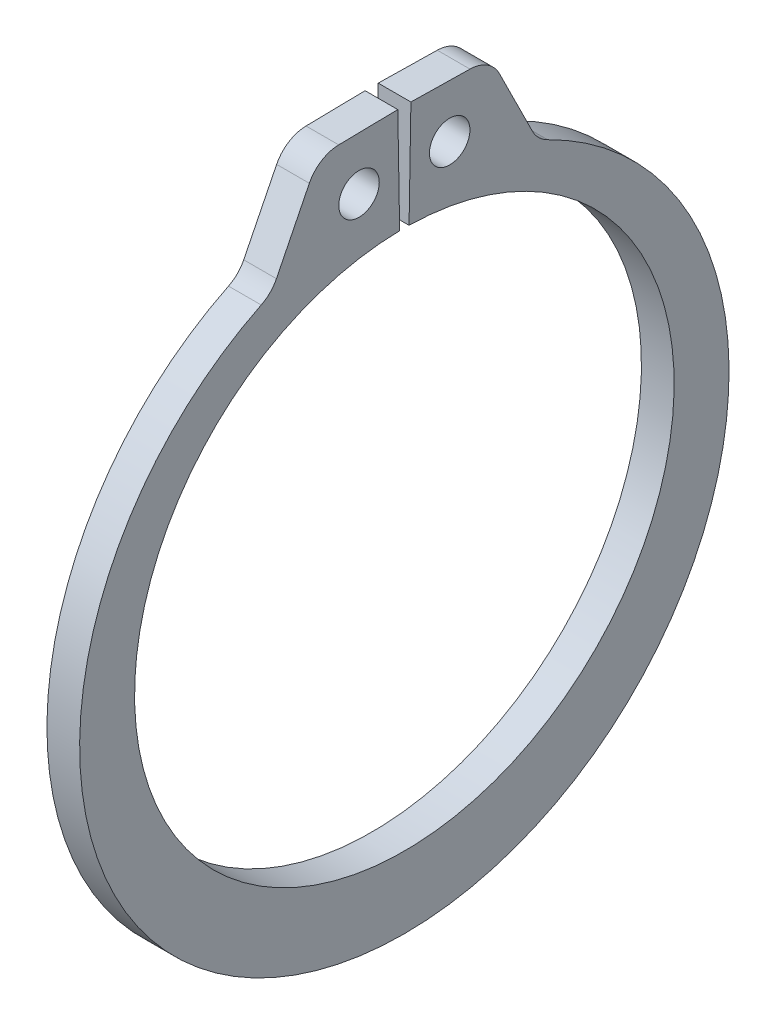
ISO-10303-21;
HEADER;
FILE_DESCRIPTION(('STEP AP214'),'2;1');
FILE_NAME('part.step','',(''),(''),'','','');
FILE_SCHEMA(('AUTOMOTIVE_DESIGN { 1 0 10303 214 1 1 1 1 }'));
ENDSEC;
DATA;
#1=APPLICATION_CONTEXT('core data for automotive mechanical design processes');
#2=APPLICATION_PROTOCOL_DEFINITION('international standard','automotive_design',2000,#1);
#3=PRODUCT_CONTEXT('',#1,'mechanical');
#4=PRODUCT('Part','Part','',(#3));
#5=PRODUCT_RELATED_PRODUCT_CATEGORY('part','',(#4));
#6=PRODUCT_DEFINITION_FORMATION('','',#4);
#7=PRODUCT_DEFINITION_CONTEXT('part definition',#1,'design');
#8=PRODUCT_DEFINITION('design','',#6,#7);
#9=PRODUCT_DEFINITION_SHAPE('','',#8);
#10=(LENGTH_UNIT() NAMED_UNIT(*) SI_UNIT(.MILLI.,.METRE.));
#11=(NAMED_UNIT(*) PLANE_ANGLE_UNIT() SI_UNIT($,.RADIAN.));
#12=(NAMED_UNIT(*) SI_UNIT($,.STERADIAN.) SOLID_ANGLE_UNIT());
#13=UNCERTAINTY_MEASURE_WITH_UNIT(LENGTH_MEASURE(1.E-05),#10,'distance_accuracy_value','');
#14=(GEOMETRIC_REPRESENTATION_CONTEXT(3) GLOBAL_UNCERTAINTY_ASSIGNED_CONTEXT((#13)) GLOBAL_UNIT_ASSIGNED_CONTEXT((#10,
#11,#12)) REPRESENTATION_CONTEXT('',''));
#15=CARTESIAN_POINT('',(0.,0.,0.));
#16=DIRECTION('',(0.,0.,1.));
#17=DIRECTION('',(1.,0.,0.));
#18=AXIS2_PLACEMENT_3D('',#15,#16,#17);
#19=CARTESIAN_POINT('',(0.5334,0.,0.));
#20=DIRECTION('',(1.,0.,0.));
#21=DIRECTION('',(0.,0.,-1.));
#22=AXIS2_PLACEMENT_3D('',#19,#20,#21);
#23=PLANE('',#22);
#24=CARTESIAN_POINT('',(0.5334,10.5040886416162,1.47894687499925));
#25=DIRECTION('',(1.,0.,0.));
#26=DIRECTION('',(0.,0.,-1.));
#27=AXIS2_PLACEMENT_3D('',#24,#25,#26);
#28=CIRCLE('',#27,0.6604);
#29=CARTESIAN_POINT('',(0.5334,10.5040886416162,0.818546874999249));
#30=VERTEX_POINT('',#29);
#31=EDGE_CURVE('E221',#30,#30,#28,.T.);
#32=ORIENTED_EDGE('',*,*,#31,.F.);
#33=EDGE_LOOP('',(#32));
#34=FACE_BOUND('',#33,.T.);
#35=DIRECTION('',(0.,-0.0174524064372888,0.999847695156391));
#36=VECTOR('',#35,1.);
#37=CARTESIAN_POINT('',(0.5334,12.2536334279892,0.213887967092128));
#38=LINE('',#37,#36);
#39=CARTESIAN_POINT('',(0.5334,12.2536334279892,0.213887967092128));
#40=VERTEX_POINT('',#39);
#41=CARTESIAN_POINT('',(0.5334,12.21999978275,2.14075821234739));
#42=VERTEX_POINT('',#41);
#43=EDGE_CURVE('E133',#40,#42,#38,.T.);
#44=ORIENTED_EDGE('',*,*,#43,.T.);
#45=CARTESIAN_POINT('',(0.5334,11.1279661301002,2.12169669403658));
#46=DIRECTION('',(1.,0.,0.));
#47=DIRECTION('',(0.,0.,-1.));
#48=AXIS2_PLACEMENT_3D('',#45,#46,#47);
#49=CIRCLE('',#48,1.0922);
#50=CARTESIAN_POINT('',(0.5334,11.6141614114107,3.09971253666458));
#51=VERTEX_POINT('',#50);
#52=EDGE_CURVE('E174',#42,#51,#49,.T.);
#53=ORIENTED_EDGE('',*,*,#52,.T.);
#54=DIRECTION('',(0.,-0.895454900776411,0.445152244378829));
#55=VECTOR('',#54,1.);
#56=CARTESIAN_POINT('',(0.5334,12.2084177333914,2.80429337570331));
#57=LINE('',#56,#55);
#58=CARTESIAN_POINT('',(0.5334,9.45539137797144,4.17288922557434));
#59=VERTEX_POINT('',#58);
#60=EDGE_CURVE('E213',#51,#59,#57,.T.);
#61=ORIENTED_EDGE('',*,*,#60,.T.);
#62=CARTESIAN_POINT('',(0.5334,9.941586659282,5.15090506820234));
#63=DIRECTION('',(1.,0.,0.));
#64=DIRECTION('',(0.,0.,-1.));
#65=AXIS2_PLACEMENT_3D('',#62,#63,#64);
#66=CIRCLE('',#65,1.0922);
#67=CARTESIAN_POINT('',(0.5334,8.96124610534802,4.66941442622431));
#68=VERTEX_POINT('',#67);
#69=EDGE_CURVE('E181',#59,#68,#66,.F.);
#70=ORIENTED_EDGE('',*,*,#69,.T.);
#71=CARTESIAN_POINT('',(0.5334,-0.545929997486655,0.));
#72=DIRECTION('',(1.,0.,0.));
#73=DIRECTION('',(0.,0.,-1.));
#74=AXIS2_PLACEMENT_3D('',#71,#72,#73);
#75=CIRCLE('',#74,10.5919700025133);
#76=CARTESIAN_POINT('',(0.5334,8.96124610534802,-4.66941442622431));
#77=VERTEX_POINT('',#76);
#78=EDGE_CURVE('E206',#68,#77,#75,.T.);
#79=ORIENTED_EDGE('',*,*,#78,.T.);
#80=CARTESIAN_POINT('',(0.5334,9.941586659282,-5.15090506820234));
#81=DIRECTION('',(1.,0.,0.));
#82=DIRECTION('',(0.,0.,-1.));
#83=AXIS2_PLACEMENT_3D('',#80,#81,#82);
#84=CIRCLE('',#83,1.0922);
#85=CARTESIAN_POINT('',(0.5334,9.45539137797144,-4.17288922557434));
#86=VERTEX_POINT('',#85);
#87=EDGE_CURVE('E11',#77,#86,#84,.F.);
#88=ORIENTED_EDGE('',*,*,#87,.T.);
#89=DIRECTION('',(0.,0.895454900776411,0.445152244378829));
#90=VECTOR('',#89,1.);
#91=CARTESIAN_POINT('',(0.5334,12.2084177333914,-2.80429337570331));
#92=LINE('',#91,#90);
#93=CARTESIAN_POINT('',(0.5334,11.6141614114107,-3.09971253666458));
#94=VERTEX_POINT('',#93);
#95=EDGE_CURVE('E205',#86,#94,#92,.T.);
#96=ORIENTED_EDGE('',*,*,#95,.T.);
#97=CARTESIAN_POINT('',(0.5334,11.1279661301002,-2.12169669403658));
#98=DIRECTION('',(1.,0.,0.));
#99=DIRECTION('',(0.,0.,-1.));
#100=AXIS2_PLACEMENT_3D('',#97,#98,#99);
#101=CIRCLE('',#100,1.0922);
#102=CARTESIAN_POINT('',(0.5334,12.21999978275,-2.14075821234739));
#103=VERTEX_POINT('',#102);
#104=EDGE_CURVE('E49',#94,#103,#101,.T.);
#105=ORIENTED_EDGE('',*,*,#104,.T.);
#106=DIRECTION('',(0.,0.0174524064372888,0.999847695156391));
#107=VECTOR('',#106,1.);
#108=CARTESIAN_POINT('',(0.5334,12.2536334279892,-0.213887967092128));
#109=LINE('',#108,#107);
#110=CARTESIAN_POINT('',(0.5334,12.2536334279892,-0.213887967092128));
#111=VERTEX_POINT('',#110);
#112=EDGE_CURVE('E210',#103,#111,#109,.T.);
#113=ORIENTED_EDGE('',*,*,#112,.T.);
#114=DIRECTION('',(0.,-0.999847695156391,0.0174524064372835));
#115=VECTOR('',#114,1.);
#116=CARTESIAN_POINT('',(0.5334,8.79975954984091,-0.153600374295176));
#117=LINE('',#116,#115);
#118=CARTESIAN_POINT('',(0.5334,8.79975954984091,-0.153600374295176));
#119=VERTEX_POINT('',#118);
#120=EDGE_CURVE('E139',#111,#119,#117,.T.);
#121=ORIENTED_EDGE('',*,*,#120,.T.);
#122=CARTESIAN_POINT('',(0.5334,0.,0.));
#123=DIRECTION('',(-1.,0.,0.));
#124=DIRECTION('',(0.,0.,-1.));
#125=AXIS2_PLACEMENT_3D('',#122,#123,#124);
#126=CIRCLE('',#125,8.8011);
#127=CARTESIAN_POINT('',(0.5334,8.79975954984091,0.153600374295176));
#128=VERTEX_POINT('',#127);
#129=EDGE_CURVE('E134',#119,#128,#126,.T.);
#130=ORIENTED_EDGE('',*,*,#129,.T.);
#131=DIRECTION('',(0.,0.999847695156391,0.0174524064372835));
#132=VECTOR('',#131,1.);
#133=CARTESIAN_POINT('',(0.5334,8.79975954984091,0.153600374295176));
#134=LINE('',#133,#132);
#135=EDGE_CURVE('E125',#128,#40,#134,.T.);
#136=ORIENTED_EDGE('',*,*,#135,.T.);
#137=EDGE_LOOP('',(#44,#53,#61,#70,#79,#88,#96,#105,#113,#121,#130,#136));
#138=FACE_BOUND('',#137,.T.);
#139=CARTESIAN_POINT('',(0.5334,10.5040886416162,-1.47894687499925));
#140=DIRECTION('',(1.,0.,0.));
#141=DIRECTION('',(0.,0.,-1.));
#142=AXIS2_PLACEMENT_3D('',#139,#140,#141);
#143=CIRCLE('',#142,0.6604);
#144=CARTESIAN_POINT('',(0.5334,10.5040886416162,-2.13934687499925));
#145=VERTEX_POINT('',#144);
#146=EDGE_CURVE('E247',#145,#145,#143,.T.);
#147=ORIENTED_EDGE('',*,*,#146,.F.);
#148=EDGE_LOOP('',(#147));
#149=FACE_BOUND('',#148,.T.);
#150=ADVANCED_FACE('F34',(#34,#138,#149),#23,.T.);
#151=CARTESIAN_POINT('',(-0.5334,0.,0.));
#152=DIRECTION('',(1.,0.,0.));
#153=DIRECTION('',(0.,0.,-1.));
#154=AXIS2_PLACEMENT_3D('',#151,#152,#153);
#155=PLANE('',#154);
#156=CARTESIAN_POINT('',(-0.5334,10.5040886416162,1.47894687499925));
#157=DIRECTION('',(1.,0.,0.));
#158=DIRECTION('',(0.,0.,-1.));
#159=AXIS2_PLACEMENT_3D('',#156,#157,#158);
#160=CIRCLE('',#159,0.6604);
#161=CARTESIAN_POINT('',(-0.5334,10.5040886416162,0.818546874999249));
#162=VERTEX_POINT('',#161);
#163=EDGE_CURVE('E244',#162,#162,#160,.T.);
#164=ORIENTED_EDGE('',*,*,#163,.T.);
#165=EDGE_LOOP('',(#164));
#166=FACE_BOUND('',#165,.T.);
#167=DIRECTION('',(0.,-0.895454900776411,0.445152244378829));
#168=VECTOR('',#167,1.);
#169=CARTESIAN_POINT('',(-0.5334,12.2084177333914,2.80429337570331));
#170=LINE('',#169,#168);
#171=CARTESIAN_POINT('',(-0.5334,11.6141614114107,3.09971253666458));
#172=VERTEX_POINT('',#171);
#173=CARTESIAN_POINT('',(-0.5334,9.45539137797144,4.17288922557434));
#174=VERTEX_POINT('',#173);
#175=EDGE_CURVE('E200',#172,#174,#170,.T.);
#176=ORIENTED_EDGE('',*,*,#175,.F.);
#177=CARTESIAN_POINT('',(-0.5334,11.1279661301002,2.12169669403658));
#178=DIRECTION('',(1.,0.,0.));
#179=DIRECTION('',(0.,0.,-1.));
#180=AXIS2_PLACEMENT_3D('',#177,#178,#179);
#181=CIRCLE('',#180,1.0922);
#182=CARTESIAN_POINT('',(-0.5334,12.21999978275,2.14075821234739));
#183=VERTEX_POINT('',#182);
#184=EDGE_CURVE('E170',#172,#183,#181,.F.);
#185=ORIENTED_EDGE('',*,*,#184,.T.);
#186=DIRECTION('',(0.,-0.0174524064372888,0.999847695156391));
#187=VECTOR('',#186,1.);
#188=CARTESIAN_POINT('',(-0.5334,12.2536334279892,0.213887967092128));
#189=LINE('',#188,#187);
#190=CARTESIAN_POINT('',(-0.5334,12.2536334279892,0.213887967092128));
#191=VERTEX_POINT('',#190);
#192=EDGE_CURVE('E223',#191,#183,#189,.T.);
#193=ORIENTED_EDGE('',*,*,#192,.F.);
#194=DIRECTION('',(0.,0.999847695156391,0.0174524064372835));
#195=VECTOR('',#194,1.);
#196=CARTESIAN_POINT('',(-0.5334,8.79975954984091,0.153600374295176));
#197=LINE('',#196,#195);
#198=CARTESIAN_POINT('',(-0.5334,8.79975954984091,0.153600374295176));
#199=VERTEX_POINT('',#198);
#200=EDGE_CURVE('E220',#199,#191,#197,.T.);
#201=ORIENTED_EDGE('',*,*,#200,.F.);
#202=CARTESIAN_POINT('',(-0.5334,0.,0.));
#203=DIRECTION('',(-1.,0.,0.));
#204=DIRECTION('',(0.,0.,-1.));
#205=AXIS2_PLACEMENT_3D('',#202,#203,#204);
#206=CIRCLE('',#205,8.8011);
#207=CARTESIAN_POINT('',(-0.5334,8.79975954984091,-0.153600374295176));
#208=VERTEX_POINT('',#207);
#209=EDGE_CURVE('E147',#208,#199,#206,.T.);
#210=ORIENTED_EDGE('',*,*,#209,.F.);
#211=DIRECTION('',(0.,-0.999847695156391,0.0174524064372835));
#212=VECTOR('',#211,1.);
#213=CARTESIAN_POINT('',(-0.5334,8.79975954984091,-0.153600374295176));
#214=LINE('',#213,#212);
#215=CARTESIAN_POINT('',(-0.5334,12.2536334279892,-0.213887967092128));
#216=VERTEX_POINT('',#215);
#217=EDGE_CURVE('E143',#216,#208,#214,.T.);
#218=ORIENTED_EDGE('',*,*,#217,.F.);
#219=DIRECTION('',(0.,0.0174524064372888,0.999847695156391));
#220=VECTOR('',#219,1.);
#221=CARTESIAN_POINT('',(-0.5334,12.2536334279892,-0.213887967092128));
#222=LINE('',#221,#220);
#223=CARTESIAN_POINT('',(-0.5334,12.21999978275,-2.14075821234739));
#224=VERTEX_POINT('',#223);
#225=EDGE_CURVE('E228',#224,#216,#222,.T.);
#226=ORIENTED_EDGE('',*,*,#225,.F.);
#227=CARTESIAN_POINT('',(-0.5334,11.1279661301002,-2.12169669403658));
#228=DIRECTION('',(1.,0.,0.));
#229=DIRECTION('',(0.,0.,-1.));
#230=AXIS2_PLACEMENT_3D('',#227,#228,#229);
#231=CIRCLE('',#230,1.0922);
#232=CARTESIAN_POINT('',(-0.5334,11.6141614114107,-3.09971253666458));
#233=VERTEX_POINT('',#232);
#234=EDGE_CURVE('E168',#224,#233,#231,.F.);
#235=ORIENTED_EDGE('',*,*,#234,.T.);
#236=DIRECTION('',(0.,0.895454900776411,0.445152244378829));
#237=VECTOR('',#236,1.);
#238=CARTESIAN_POINT('',(-0.5334,12.2084177333914,-2.80429337570331));
#239=LINE('',#238,#237);
#240=CARTESIAN_POINT('',(-0.5334,9.45539137797144,-4.17288922557434));
#241=VERTEX_POINT('',#240);
#242=EDGE_CURVE('E191',#241,#233,#239,.T.);
#243=ORIENTED_EDGE('',*,*,#242,.F.);
#244=CARTESIAN_POINT('',(-0.5334,9.941586659282,-5.15090506820234));
#245=DIRECTION('',(1.,0.,0.));
#246=DIRECTION('',(0.,0.,-1.));
#247=AXIS2_PLACEMENT_3D('',#244,#245,#246);
#248=CIRCLE('',#247,1.0922);
#249=CARTESIAN_POINT('',(-0.5334,8.96124610534802,-4.66941442622431));
#250=VERTEX_POINT('',#249);
#251=EDGE_CURVE('E42',#241,#250,#248,.T.);
#252=ORIENTED_EDGE('',*,*,#251,.T.);
#253=CARTESIAN_POINT('',(-0.5334,-0.545929997486655,0.));
#254=DIRECTION('',(1.,0.,0.));
#255=DIRECTION('',(0.,0.,-1.));
#256=AXIS2_PLACEMENT_3D('',#253,#254,#255);
#257=CIRCLE('',#256,10.5919700025133);
#258=CARTESIAN_POINT('',(-0.5334,8.96124610534802,4.66941442622431));
#259=VERTEX_POINT('',#258);
#260=EDGE_CURVE('E189',#259,#250,#257,.T.);
#261=ORIENTED_EDGE('',*,*,#260,.F.);
#262=CARTESIAN_POINT('',(-0.5334,9.941586659282,5.15090506820234));
#263=DIRECTION('',(1.,0.,0.));
#264=DIRECTION('',(0.,0.,-1.));
#265=AXIS2_PLACEMENT_3D('',#262,#263,#264);
#266=CIRCLE('',#265,1.0922);
#267=EDGE_CURVE('E179',#259,#174,#266,.T.);
#268=ORIENTED_EDGE('',*,*,#267,.T.);
#269=EDGE_LOOP('',(#176,#185,#193,#201,#210,#218,#226,#235,#243,#252,#261,#268));
#270=FACE_BOUND('',#269,.T.);
#271=CARTESIAN_POINT('',(-0.5334,10.5040886416162,-1.47894687499925));
#272=DIRECTION('',(1.,0.,0.));
#273=DIRECTION('',(0.,0.,-1.));
#274=AXIS2_PLACEMENT_3D('',#271,#272,#273);
#275=CIRCLE('',#274,0.6604);
#276=CARTESIAN_POINT('',(-0.5334,10.5040886416162,-2.13934687499925));
#277=VERTEX_POINT('',#276);
#278=EDGE_CURVE('E250',#277,#277,#275,.T.);
#279=ORIENTED_EDGE('',*,*,#278,.T.);
#280=EDGE_LOOP('',(#279));
#281=FACE_BOUND('',#280,.T.);
#282=ADVANCED_FACE('F187',(#166,#270,#281),#155,.F.);
#283=CARTESIAN_POINT('',(0.5334,0.,0.));
#284=DIRECTION('',(-1.,0.,0.));
#285=DIRECTION('',(0.,0.,1.));
#286=AXIS2_PLACEMENT_3D('',#283,#284,#285);
#287=CYLINDRICAL_SURFACE('',#286,8.8011);
#288=ORIENTED_EDGE('',*,*,#209,.T.);
#289=DIRECTION('',(-1.,0.,0.));
#290=VECTOR('',#289,1.);
#291=CARTESIAN_POINT('',(0.5334,8.79975954984091,0.153600374295176));
#292=LINE('',#291,#290);
#293=EDGE_CURVE('E129',#128,#199,#292,.T.);
#294=ORIENTED_EDGE('',*,*,#293,.F.);
#295=ORIENTED_EDGE('',*,*,#129,.F.);
#296=DIRECTION('',(-1.,0.,0.));
#297=VECTOR('',#296,1.);
#298=CARTESIAN_POINT('',(0.5334,8.79975954984091,-0.153600374295176));
#299=LINE('',#298,#297);
#300=EDGE_CURVE('E218',#119,#208,#299,.T.);
#301=ORIENTED_EDGE('',*,*,#300,.T.);
#302=EDGE_LOOP('',(#288,#294,#295,#301));
#303=FACE_BOUND('',#302,.T.);
#304=ADVANCED_FACE('F145',(#303),#287,.F.);
#305=CARTESIAN_POINT('',(0.5334,8.79975954984091,0.153600374295176));
#306=DIRECTION('',(0.,-0.0174524064372835,0.999847695156391));
#307=DIRECTION('',(0.,-0.999847695156391,-0.0174524064372835));
#308=AXIS2_PLACEMENT_3D('',#305,#306,#307);
#309=PLANE('',#308);
#310=ORIENTED_EDGE('',*,*,#200,.T.);
#311=DIRECTION('',(-1.,0.,0.));
#312=VECTOR('',#311,1.);
#313=CARTESIAN_POINT('',(0.5334,12.2536334279892,0.213887967092128));
#314=LINE('',#313,#312);
#315=EDGE_CURVE('E132',#40,#191,#314,.T.);
#316=ORIENTED_EDGE('',*,*,#315,.F.);
#317=ORIENTED_EDGE('',*,*,#135,.F.);
#318=ORIENTED_EDGE('',*,*,#293,.T.);
#319=EDGE_LOOP('',(#310,#316,#317,#318));
#320=FACE_BOUND('',#319,.T.);
#321=ADVANCED_FACE('F127',(#320),#309,.F.);
#322=CARTESIAN_POINT('',(0.5334,12.2536334279892,0.213887967092128));
#323=DIRECTION('',(0.,-0.999847695156391,-0.0174524064372888));
#324=DIRECTION('',(0.,0.0174524064372888,-0.999847695156391));
#325=AXIS2_PLACEMENT_3D('',#322,#323,#324);
#326=PLANE('',#325);
#327=ORIENTED_EDGE('',*,*,#192,.T.);
#328=DIRECTION('',(-1.,0.,0.));
#329=VECTOR('',#328,1.);
#330=CARTESIAN_POINT('',(0.5334,12.21999978275,2.14075821234739));
#331=LINE('',#330,#329);
#332=EDGE_CURVE('E57',#183,#42,#331,.F.);
#333=ORIENTED_EDGE('',*,*,#332,.T.);
#334=ORIENTED_EDGE('',*,*,#43,.F.);
#335=ORIENTED_EDGE('',*,*,#315,.T.);
#336=EDGE_LOOP('',(#327,#333,#334,#335));
#337=FACE_BOUND('',#336,.T.);
#338=ADVANCED_FACE('F239',(#337),#326,.F.);
#339=CARTESIAN_POINT('',(0.5334,12.2084177333914,2.80429337570331));
#340=DIRECTION('',(0.,-0.445152244378829,-0.895454900776411));
#341=DIRECTION('',(0.,0.895454900776411,-0.445152244378829));
#342=AXIS2_PLACEMENT_3D('',#339,#340,#341);
#343=PLANE('',#342);
#344=ORIENTED_EDGE('',*,*,#175,.T.);
#345=DIRECTION('',(1.,0.,0.));
#346=VECTOR('',#345,1.);
#347=CARTESIAN_POINT('',(0.5334,9.45539137797144,4.17288922557434));
#348=LINE('',#347,#346);
#349=EDGE_CURVE('E161',#174,#59,#348,.T.);
#350=ORIENTED_EDGE('',*,*,#349,.T.);
#351=ORIENTED_EDGE('',*,*,#60,.F.);
#352=DIRECTION('',(-1.,0.,0.));
#353=VECTOR('',#352,1.);
#354=CARTESIAN_POINT('',(0.5334,11.6141614114107,3.09971253666458));
#355=LINE('',#354,#353);
#356=EDGE_CURVE('E158',#51,#172,#355,.T.);
#357=ORIENTED_EDGE('',*,*,#356,.T.);
#358=EDGE_LOOP('',(#344,#350,#351,#357));
#359=FACE_BOUND('',#358,.T.);
#360=ADVANCED_FACE('F280',(#359),#343,.F.);
#361=CARTESIAN_POINT('',(0.5334,-0.545929997486655,0.));
#362=DIRECTION('',(-1.,0.,0.));
#363=DIRECTION('',(0.,0.,1.));
#364=AXIS2_PLACEMENT_3D('',#361,#362,#363);
#365=CYLINDRICAL_SURFACE('',#364,10.5919700025133);
#366=ORIENTED_EDGE('',*,*,#78,.F.);
#367=DIRECTION('',(-1.,0.,0.));
#368=VECTOR('',#367,1.);
#369=CARTESIAN_POINT('',(0.5334,8.96124610534802,4.66941442622431));
#370=LINE('',#369,#368);
#371=EDGE_CURVE('E150',#68,#259,#370,.T.);
#372=ORIENTED_EDGE('',*,*,#371,.T.);
#373=ORIENTED_EDGE('',*,*,#260,.T.);
#374=DIRECTION('',(-1.,0.,0.));
#375=VECTOR('',#374,1.);
#376=CARTESIAN_POINT('',(0.5334,8.96124610534802,-4.66941442622431));
#377=LINE('',#376,#375);
#378=EDGE_CURVE('E148',#250,#77,#377,.F.);
#379=ORIENTED_EDGE('',*,*,#378,.T.);
#380=EDGE_LOOP('',(#366,#372,#373,#379));
#381=FACE_BOUND('',#380,.T.);
#382=ADVANCED_FACE('F197',(#381),#365,.T.);
#383=CARTESIAN_POINT('',(0.5334,12.2084177333914,-2.80429337570331));
#384=DIRECTION('',(0.,-0.445152244378829,0.895454900776411));
#385=DIRECTION('',(0.,-0.895454900776411,-0.445152244378829));
#386=AXIS2_PLACEMENT_3D('',#383,#384,#385);
#387=PLANE('',#386);
#388=ORIENTED_EDGE('',*,*,#95,.F.);
#389=DIRECTION('',(1.,0.,0.));
#390=VECTOR('',#389,1.);
#391=CARTESIAN_POINT('',(-0.5334,9.45539137797144,-4.17288922557434));
#392=LINE('',#391,#390);
#393=EDGE_CURVE('E165',#86,#241,#392,.F.);
#394=ORIENTED_EDGE('',*,*,#393,.T.);
#395=ORIENTED_EDGE('',*,*,#242,.T.);
#396=DIRECTION('',(-1.,0.,0.));
#397=VECTOR('',#396,1.);
#398=CARTESIAN_POINT('',(0.5334,11.6141614114107,-3.09971253666458));
#399=LINE('',#398,#397);
#400=EDGE_CURVE('E163',#233,#94,#399,.F.);
#401=ORIENTED_EDGE('',*,*,#400,.T.);
#402=EDGE_LOOP('',(#388,#394,#395,#401));
#403=FACE_BOUND('',#402,.T.);
#404=ADVANCED_FACE('F208',(#403),#387,.F.);
#405=CARTESIAN_POINT('',(0.5334,12.2536334279892,-0.213887967092128));
#406=DIRECTION('',(0.,-0.999847695156391,0.0174524064372888));
#407=DIRECTION('',(0.,-0.0174524064372888,-0.999847695156391));
#408=AXIS2_PLACEMENT_3D('',#405,#406,#407);
#409=PLANE('',#408);
#410=ORIENTED_EDGE('',*,*,#112,.F.);
#411=DIRECTION('',(-1.,0.,0.));
#412=VECTOR('',#411,1.);
#413=CARTESIAN_POINT('',(0.5334,12.21999978275,-2.14075821234739));
#414=LINE('',#413,#412);
#415=EDGE_CURVE('E176',#103,#224,#414,.T.);
#416=ORIENTED_EDGE('',*,*,#415,.T.);
#417=ORIENTED_EDGE('',*,*,#225,.T.);
#418=DIRECTION('',(-1.,0.,0.));
#419=VECTOR('',#418,1.);
#420=CARTESIAN_POINT('',(0.5334,12.2536334279892,-0.213887967092128));
#421=LINE('',#420,#419);
#422=EDGE_CURVE('E152',#111,#216,#421,.T.);
#423=ORIENTED_EDGE('',*,*,#422,.F.);
#424=EDGE_LOOP('',(#410,#416,#417,#423));
#425=FACE_BOUND('',#424,.T.);
#426=ADVANCED_FACE('F273',(#425),#409,.F.);
#427=CARTESIAN_POINT('',(0.5334,8.79975954984091,-0.153600374295176));
#428=DIRECTION('',(0.,-0.0174524064372835,-0.999847695156391));
#429=DIRECTION('',(0.,0.999847695156391,-0.0174524064372835));
#430=AXIS2_PLACEMENT_3D('',#427,#428,#429);
#431=PLANE('',#430);
#432=ORIENTED_EDGE('',*,*,#217,.T.);
#433=ORIENTED_EDGE('',*,*,#300,.F.);
#434=ORIENTED_EDGE('',*,*,#120,.F.);
#435=ORIENTED_EDGE('',*,*,#422,.T.);
#436=EDGE_LOOP('',(#432,#433,#434,#435));
#437=FACE_BOUND('',#436,.T.);
#438=ADVANCED_FACE('F235',(#437),#431,.F.);
#439=CARTESIAN_POINT('',(0.5334,10.5040886416162,1.47894687499925));
#440=DIRECTION('',(-1.,0.,0.));
#441=DIRECTION('',(0.,0.,1.));
#442=AXIS2_PLACEMENT_3D('',#439,#440,#441);
#443=CYLINDRICAL_SURFACE('',#442,0.6604);
#444=ORIENTED_EDGE('',*,*,#31,.T.);
#445=EDGE_LOOP('',(#444));
#446=FACE_BOUND('',#445,.T.);
#447=ORIENTED_EDGE('',*,*,#163,.F.);
#448=EDGE_LOOP('',(#447));
#449=FACE_BOUND('',#448,.T.);
#450=ADVANCED_FACE('F268',(#446,#449),#443,.F.);
#451=CARTESIAN_POINT('',(0.5334,10.5040886416162,-1.47894687499925));
#452=DIRECTION('',(-1.,0.,0.));
#453=DIRECTION('',(0.,0.,1.));
#454=AXIS2_PLACEMENT_3D('',#451,#452,#453);
#455=CYLINDRICAL_SURFACE('',#454,0.6604);
#456=ORIENTED_EDGE('',*,*,#146,.T.);
#457=EDGE_LOOP('',(#456));
#458=FACE_BOUND('',#457,.T.);
#459=ORIENTED_EDGE('',*,*,#278,.F.);
#460=EDGE_LOOP('',(#459));
#461=FACE_BOUND('',#460,.T.);
#462=ADVANCED_FACE('F256',(#458,#461),#455,.F.);
#463=CARTESIAN_POINT('',(0.5334,9.941586659282,5.15090506820234));
#464=DIRECTION('',(-1.,0.,0.));
#465=DIRECTION('',(0.,0.,1.));
#466=AXIS2_PLACEMENT_3D('',#463,#464,#465);
#467=CYLINDRICAL_SURFACE('',#466,1.0922);
#468=ORIENTED_EDGE('',*,*,#69,.F.);
#469=ORIENTED_EDGE('',*,*,#349,.F.);
#470=ORIENTED_EDGE('',*,*,#267,.F.);
#471=ORIENTED_EDGE('',*,*,#371,.F.);
#472=EDGE_LOOP('',(#468,#469,#470,#471));
#473=FACE_BOUND('',#472,.T.);
#474=ADVANCED_FACE('F290',(#473),#467,.F.);
#475=CARTESIAN_POINT('',(0.5334,9.941586659282,-5.15090506820234));
#476=DIRECTION('',(-1.,0.,0.));
#477=DIRECTION('',(0.,0.,1.));
#478=AXIS2_PLACEMENT_3D('',#475,#476,#477);
#479=CYLINDRICAL_SURFACE('',#478,1.0922);
#480=ORIENTED_EDGE('',*,*,#87,.F.);
#481=ORIENTED_EDGE('',*,*,#378,.F.);
#482=ORIENTED_EDGE('',*,*,#251,.F.);
#483=ORIENTED_EDGE('',*,*,#393,.F.);
#484=EDGE_LOOP('',(#480,#481,#482,#483));
#485=FACE_BOUND('',#484,.T.);
#486=ADVANCED_FACE('F203',(#485),#479,.F.);
#487=CARTESIAN_POINT('',(0.5334,11.1279661301002,2.12169669403658));
#488=DIRECTION('',(-1.,0.,0.));
#489=DIRECTION('',(0.,0.,1.));
#490=AXIS2_PLACEMENT_3D('',#487,#488,#489);
#491=CYLINDRICAL_SURFACE('',#490,1.0922);
#492=ORIENTED_EDGE('',*,*,#52,.F.);
#493=ORIENTED_EDGE('',*,*,#332,.F.);
#494=ORIENTED_EDGE('',*,*,#184,.F.);
#495=ORIENTED_EDGE('',*,*,#356,.F.);
#496=EDGE_LOOP('',(#492,#493,#494,#495));
#497=FACE_BOUND('',#496,.T.);
#498=ADVANCED_FACE('F295',(#497),#491,.T.);
#499=CARTESIAN_POINT('',(0.5334,11.1279661301002,-2.12169669403658));
#500=DIRECTION('',(-1.,0.,0.));
#501=DIRECTION('',(0.,0.,1.));
#502=AXIS2_PLACEMENT_3D('',#499,#500,#501);
#503=CYLINDRICAL_SURFACE('',#502,1.0922);
#504=ORIENTED_EDGE('',*,*,#104,.F.);
#505=ORIENTED_EDGE('',*,*,#400,.F.);
#506=ORIENTED_EDGE('',*,*,#234,.F.);
#507=ORIENTED_EDGE('',*,*,#415,.F.);
#508=EDGE_LOOP('',(#504,#505,#506,#507));
#509=FACE_BOUND('',#508,.T.);
#510=ADVANCED_FACE('F36',(#509),#503,.T.);
#511=CLOSED_SHELL('',(#150,#282,#304,#321,#338,#360,#382,#404,#426,#438,#450,#462,#474,#486,
#498,#510));
#512=MANIFOLD_SOLID_BREP('B2',#511);
#513=ADVANCED_BREP_SHAPE_REPRESENTATION('',(#18,#512),#14);
#514=SHAPE_DEFINITION_REPRESENTATION(#9,#513);
ENDSEC;
END-ISO-10303-21;
